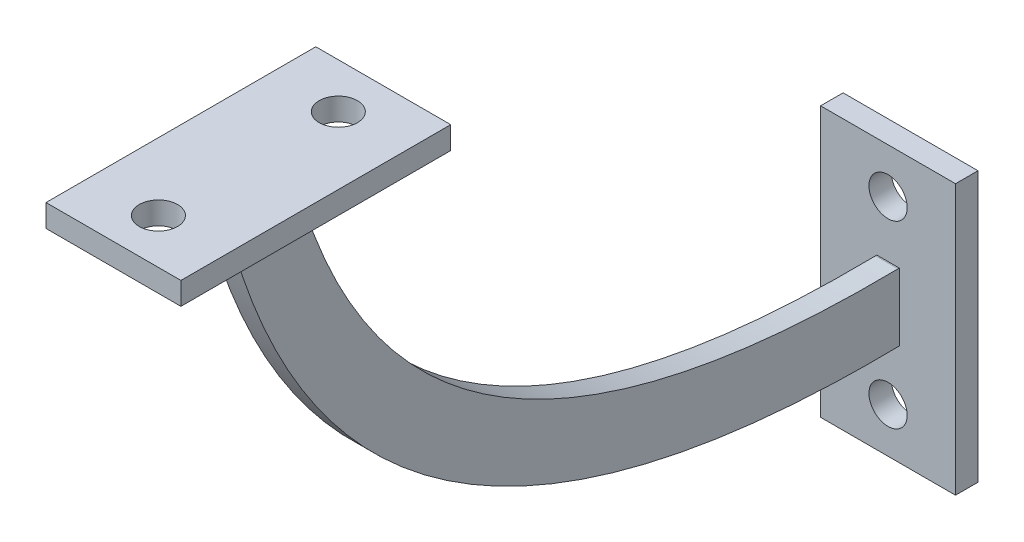
ISO-10303-21;
HEADER;
FILE_DESCRIPTION(('STEP AP214'),'2;1');
FILE_NAME('part.step','',(''),(''),'','','');
FILE_SCHEMA(('AUTOMOTIVE_DESIGN { 1 0 10303 214 1 1 1 1 }'));
ENDSEC;
DATA;
#1=APPLICATION_CONTEXT('core data for automotive mechanical design processes');
#2=APPLICATION_PROTOCOL_DEFINITION('international standard','automotive_design',2000,#1);
#3=PRODUCT_CONTEXT('',#1,'mechanical');
#4=PRODUCT('Part','Part','',(#3));
#5=PRODUCT_RELATED_PRODUCT_CATEGORY('part','',(#4));
#6=PRODUCT_DEFINITION_FORMATION('','',#4);
#7=PRODUCT_DEFINITION_CONTEXT('part definition',#1,'design');
#8=PRODUCT_DEFINITION('design','',#6,#7);
#9=PRODUCT_DEFINITION_SHAPE('','',#8);
#10=(LENGTH_UNIT() NAMED_UNIT(*) SI_UNIT(.MILLI.,.METRE.));
#11=(NAMED_UNIT(*) PLANE_ANGLE_UNIT() SI_UNIT($,.RADIAN.));
#12=(NAMED_UNIT(*) SI_UNIT($,.STERADIAN.) SOLID_ANGLE_UNIT());
#13=UNCERTAINTY_MEASURE_WITH_UNIT(LENGTH_MEASURE(1.E-05),#10,'distance_accuracy_value','');
#14=(GEOMETRIC_REPRESENTATION_CONTEXT(3) GLOBAL_UNCERTAINTY_ASSIGNED_CONTEXT((#13)) GLOBAL_UNIT_ASSIGNED_CONTEXT((#10,
#11,#12)) REPRESENTATION_CONTEXT('',''));
#15=CARTESIAN_POINT('',(0.,0.,0.));
#16=DIRECTION('',(0.,0.,1.));
#17=DIRECTION('',(1.,0.,0.));
#18=AXIS2_PLACEMENT_3D('',#15,#16,#17);
#19=CARTESIAN_POINT('',(5.,100.,150.));
#20=CARTESIAN_POINT('',(5.,-2.14164180963556,124.823277557777));
#21=CARTESIAN_POINT('',(5.,0.,0.));
#22=B_SPLINE_CURVE_WITH_KNOTS('',2,(#19,#20,#21),.UNSPECIFIED.,.F.,.F.,(3,3),(0.,1.),.UNSPECIFIED.);
#23=DIRECTION('',(-1.,0.,0.));
#24=VECTOR('',#23,1.);
#25=SURFACE_OF_LINEAR_EXTRUSION('',#22,#24);
#26=CARTESIAN_POINT('',(0.,100.,150.));
#27=CARTESIAN_POINT('',(0.,-2.14164180963556,124.823277557777));
#28=CARTESIAN_POINT('',(0.,0.,0.));
#29=B_SPLINE_CURVE_WITH_KNOTS('',2,(#26,#27,#28),.UNSPECIFIED.,.F.,.F.,(3,3),(0.,1.),.UNSPECIFIED.);
#30=CARTESIAN_POINT('',(0.,99.9999999999997,150.));
#31=VERTEX_POINT('',#30);
#32=CARTESIAN_POINT('',(0.,0.,0.));
#33=VERTEX_POINT('',#32);
#34=EDGE_CURVE('E139',#31,#33,#29,.T.);
#35=ORIENTED_EDGE('',*,*,#34,.T.);
#36=DIRECTION('',(-1.,0.,0.));
#37=VECTOR('',#36,1.);
#38=CARTESIAN_POINT('',(5.,0.,0.));
#39=LINE('',#38,#37);
#40=CARTESIAN_POINT('',(5.,0.,0.));
#41=VERTEX_POINT('',#40);
#42=EDGE_CURVE('E11',#41,#33,#39,.T.);
#43=ORIENTED_EDGE('',*,*,#42,.F.);
#44=CARTESIAN_POINT('',(5.,100.,150.));
#45=VERTEX_POINT('',#44);
#46=EDGE_CURVE('E86',#45,#41,#22,.T.);
#47=ORIENTED_EDGE('',*,*,#46,.F.);
#48=DIRECTION('',(-1.,0.,0.));
#49=VECTOR('',#48,1.);
#50=CARTESIAN_POINT('',(5.,100.,150.));
#51=LINE('',#50,#49);
#52=EDGE_CURVE('E114',#45,#31,#51,.T.);
#53=ORIENTED_EDGE('',*,*,#52,.T.);
#54=EDGE_LOOP('',(#35,#43,#47,#53));
#55=FACE_BOUND('',#54,.T.);
#56=ADVANCED_FACE('F41',(#55),#25,.F.);
#57=CARTESIAN_POINT('',(5.,14.9977926667699,0.257322996606405));
#58=DIRECTION('',(0.,-0.999963210436096,-0.0085777487918578));
#59=DIRECTION('',(0.,0.0085777487918578,-0.999963210436096));
#60=AXIS2_PLACEMENT_3D('',#57,#58,#59);
#61=PLANE('',#60);
#62=DIRECTION('',(0.,-0.0085777487918578,0.999963210436096));
#63=VECTOR('',#62,1.);
#64=CARTESIAN_POINT('',(0.,14.9977926667699,0.257322996606405));
#65=LINE('',#64,#63);
#66=CARTESIAN_POINT('',(0.,15.,0.));
#67=VERTEX_POINT('',#66);
#68=CARTESIAN_POINT('',(0.,14.9977926667699,0.257322996606405));
#69=VERTEX_POINT('',#68);
#70=EDGE_CURVE('E73',#67,#69,#65,.T.);
#71=ORIENTED_EDGE('',*,*,#70,.T.);
#72=DIRECTION('',(-1.,0.,0.));
#73=VECTOR('',#72,1.);
#74=CARTESIAN_POINT('',(5.,14.9977926667699,0.257322996606405));
#75=LINE('',#74,#73);
#76=CARTESIAN_POINT('',(5.,14.9977926667699,0.257322996606405));
#77=VERTEX_POINT('',#76);
#78=EDGE_CURVE('E103',#77,#69,#75,.T.);
#79=ORIENTED_EDGE('',*,*,#78,.F.);
#80=DIRECTION('',(0.,-0.0085777487918578,0.999963210436096));
#81=VECTOR('',#80,1.);
#82=CARTESIAN_POINT('',(5.,14.9977926667699,0.257322996606405));
#83=LINE('',#82,#81);
#84=CARTESIAN_POINT('',(5.,15.,0.));
#85=VERTEX_POINT('',#84);
#86=EDGE_CURVE('E93',#85,#77,#83,.T.);
#87=ORIENTED_EDGE('',*,*,#86,.F.);
#88=DIRECTION('',(-1.,0.,0.));
#89=VECTOR('',#88,1.);
#90=CARTESIAN_POINT('',(5.,15.,0.));
#91=LINE('',#90,#89);
#92=EDGE_CURVE('E51',#85,#67,#91,.T.);
#93=ORIENTED_EDGE('',*,*,#92,.T.);
#94=EDGE_LOOP('',(#71,#79,#87,#93));
#95=FACE_BOUND('',#94,.T.);
#96=ADVANCED_FACE('F104',(#95),#61,.F.);
#97=CARTESIAN_POINT('',(5.,14.9977926667699,0.257322996606407));
#98=CARTESIAN_POINT('',(5.,14.6393775309061,22.513069097096));
#99=CARTESIAN_POINT('',(5.,19.6797432725881,53.120235991017));
#100=CARTESIAN_POINT('',(5.,26.5385989413839,74.1752355396005));
#101=CARTESIAN_POINT('',(5.,36.0765405139787,91.9642188804717));
#102=CARTESIAN_POINT('',(5.,48.2663544222022,106.790873122833));
#103=CARTESIAN_POINT('',(5.,63.2983661781123,118.971580699375));
#104=CARTESIAN_POINT('',(5.,86.044389394246,131.079744309968));
#105=CARTESIAN_POINT('',(5.,103.588437748394,135.441554164153));
#106=B_SPLINE_CURVE_WITH_KNOTS('',2,(#97,#98,#99,#100,#101,#102,#103,#104,#105),.UNSPECIFIED.,
.F.,.F.,(3,1,1,1,1,1,1,3),(0.,0.1875,0.3125,0.4375,0.5625,0.6875,0.8125,1.),.UNSPECIFIED.);
#107=DIRECTION('',(-1.,0.,0.));
#108=VECTOR('',#107,1.);
#109=SURFACE_OF_LINEAR_EXTRUSION('',#106,#108);
#110=CARTESIAN_POINT('',(0.,14.9977926667699,0.257322996606407));
#111=CARTESIAN_POINT('',(0.,14.6393775309061,22.513069097096));
#112=CARTESIAN_POINT('',(0.,19.6797432725881,53.120235991017));
#113=CARTESIAN_POINT('',(0.,26.5385989413839,74.1752355396005));
#114=CARTESIAN_POINT('',(0.,36.0765405139787,91.9642188804717));
#115=CARTESIAN_POINT('',(0.,48.2663544222022,106.790873122833));
#116=CARTESIAN_POINT('',(0.,63.2983661781123,118.971580699375));
#117=CARTESIAN_POINT('',(0.,86.044389394246,131.079744309968));
#118=CARTESIAN_POINT('',(0.,103.588437748394,135.441554164153));
#119=B_SPLINE_CURVE_WITH_KNOTS('',2,(#110,#111,#112,#113,#114,#115,#116,#117,#118),
.UNSPECIFIED.,.F.,.F.,(3,1,1,1,1,1,1,3),(0.,0.1875,0.3125,0.4375,0.5625,0.6875,0.8125,1.),.UNSPECIFIED.);
#120=CARTESIAN_POINT('',(0.,100.,134.50795277409));
#121=VERTEX_POINT('',#120);
#122=EDGE_CURVE('E556',#69,#121,#119,.T.);
#123=ORIENTED_EDGE('',*,*,#122,.T.);
#124=DIRECTION('',(-1.,0.,0.));
#125=VECTOR('',#124,1.);
#126=CARTESIAN_POINT('',(5.,100.,134.50795277409));
#127=LINE('',#126,#125);
#128=CARTESIAN_POINT('',(5.,100.,134.50795277409));
#129=VERTEX_POINT('',#128);
#130=EDGE_CURVE('E107',#129,#121,#127,.T.);
#131=ORIENTED_EDGE('',*,*,#130,.F.);
#132=EDGE_CURVE('E96',#77,#129,#106,.T.);
#133=ORIENTED_EDGE('',*,*,#132,.F.);
#134=ORIENTED_EDGE('',*,*,#78,.T.);
#135=EDGE_LOOP('',(#123,#131,#133,#134));
#136=FACE_BOUND('',#135,.T.);
#137=ADVANCED_FACE('F109',(#136),#109,.F.);
#138=CARTESIAN_POINT('',(5.,23.9291790951822,99.9116387788885));
#139=DIRECTION('',(1.,0.,0.));
#140=DIRECTION('',(0.,0.,-1.));
#141=AXIS2_PLACEMENT_3D('',#138,#139,#140);
#142=PLANE('',#141);
#143=ORIENTED_EDGE('',*,*,#46,.T.);
#144=DIRECTION('',(0.,1.,0.));
#145=VECTOR('',#144,1.);
#146=CARTESIAN_POINT('',(5.,0.,0.));
#147=LINE('',#146,#145);
#148=EDGE_CURVE('E99',#41,#85,#147,.T.);
#149=ORIENTED_EDGE('',*,*,#148,.T.);
#150=ORIENTED_EDGE('',*,*,#86,.T.);
#151=ORIENTED_EDGE('',*,*,#132,.T.);
#152=DIRECTION('',(0.,0.,1.));
#153=VECTOR('',#152,1.);
#154=CARTESIAN_POINT('',(5.,100.,135.));
#155=LINE('',#154,#153);
#156=EDGE_CURVE('E59',#129,#45,#155,.T.);
#157=ORIENTED_EDGE('',*,*,#156,.T.);
#158=EDGE_LOOP('',(#143,#149,#150,#151,#157));
#159=FACE_BOUND('',#158,.T.);
#160=ADVANCED_FACE('F94',(#159),#142,.T.);
#161=CARTESIAN_POINT('',(0.,23.9291790951822,99.9116387788885));
#162=DIRECTION('',(1.,0.,0.));
#163=DIRECTION('',(0.,0.,-1.));
#164=AXIS2_PLACEMENT_3D('',#161,#162,#163);
#165=PLANE('',#164);
#166=ORIENTED_EDGE('',*,*,#34,.F.);
#167=DIRECTION('',(0.,0.,1.));
#168=VECTOR('',#167,1.);
#169=CARTESIAN_POINT('',(0.,100.,150.));
#170=LINE('',#169,#168);
#171=EDGE_CURVE('E81',#121,#31,#170,.T.);
#172=ORIENTED_EDGE('',*,*,#171,.F.);
#173=ORIENTED_EDGE('',*,*,#122,.F.);
#174=ORIENTED_EDGE('',*,*,#70,.F.);
#175=DIRECTION('',(0.,1.,0.));
#176=VECTOR('',#175,1.);
#177=CARTESIAN_POINT('',(0.,0.,0.));
#178=LINE('',#177,#176);
#179=EDGE_CURVE('E146',#33,#67,#178,.T.);
#180=ORIENTED_EDGE('',*,*,#179,.F.);
#181=EDGE_LOOP('',(#166,#172,#173,#174,#180));
#182=FACE_BOUND('',#181,.T.);
#183=ADVANCED_FACE('F127',(#182),#165,.F.);
#184=CARTESIAN_POINT('',(0.,105.,2.18614614331551E-13));
#185=DIRECTION('',(0.,-1.,0.));
#186=DIRECTION('',(0.,0.,-1.));
#187=AXIS2_PLACEMENT_3D('',#184,#185,#186);
#188=PLANE('',#187);
#189=DIRECTION('',(0.,0.,-1.));
#190=VECTOR('',#189,1.);
#191=CARTESIAN_POINT('',(17.5,105.,172.253976387045));
#192=LINE('',#191,#190);
#193=CARTESIAN_POINT('',(17.5,105.,172.253976387045));
#194=VERTEX_POINT('',#193);
#195=CARTESIAN_POINT('',(17.5,105.,112.253976387045));
#196=VERTEX_POINT('',#195);
#197=EDGE_CURVE('E182',#194,#196,#192,.T.);
#198=ORIENTED_EDGE('',*,*,#197,.T.);
#199=DIRECTION('',(-1.,0.,0.));
#200=VECTOR('',#199,1.);
#201=CARTESIAN_POINT('',(-12.5,105.,112.253976387045));
#202=LINE('',#201,#200);
#203=CARTESIAN_POINT('',(-12.5,105.,112.253976387045));
#204=VERTEX_POINT('',#203);
#205=EDGE_CURVE('E203',#196,#204,#202,.T.);
#206=ORIENTED_EDGE('',*,*,#205,.T.);
#207=DIRECTION('',(0.,0.,1.));
#208=VECTOR('',#207,1.);
#209=CARTESIAN_POINT('',(-12.5,105.,172.253976387045));
#210=LINE('',#209,#208);
#211=CARTESIAN_POINT('',(-12.5,105.,172.253976387045));
#212=VERTEX_POINT('',#211);
#213=EDGE_CURVE('E199',#204,#212,#210,.T.);
#214=ORIENTED_EDGE('',*,*,#213,.T.);
#215=DIRECTION('',(1.,0.,0.));
#216=VECTOR('',#215,1.);
#217=CARTESIAN_POINT('',(-12.5,105.,172.253976387045));
#218=LINE('',#217,#216);
#219=EDGE_CURVE('E177',#212,#194,#218,.T.);
#220=ORIENTED_EDGE('',*,*,#219,.T.);
#221=EDGE_LOOP('',(#198,#206,#214,#220));
#222=FACE_BOUND('',#221,.T.);
#223=CARTESIAN_POINT('',(2.5,105.,162.253976387045));
#224=DIRECTION('',(0.,1.,0.));
#225=DIRECTION('',(0.,0.,1.));
#226=AXIS2_PLACEMENT_3D('',#223,#224,#225);
#227=CIRCLE('',#226,4.25);
#228=CARTESIAN_POINT('',(2.5,105.,166.503976387045));
#229=VERTEX_POINT('',#228);
#230=EDGE_CURVE('E195',#229,#229,#227,.T.);
#231=ORIENTED_EDGE('',*,*,#230,.F.);
#232=EDGE_LOOP('',(#231));
#233=FACE_BOUND('',#232,.T.);
#234=CARTESIAN_POINT('',(2.5,105.,122.253976387045));
#235=DIRECTION('',(0.,1.,0.));
#236=DIRECTION('',(0.,0.,-1.));
#237=AXIS2_PLACEMENT_3D('',#234,#235,#236);
#238=CIRCLE('',#237,4.25);
#239=CARTESIAN_POINT('',(2.5,105.,118.003976387045));
#240=VERTEX_POINT('',#239);
#241=EDGE_CURVE('E214',#240,#240,#238,.T.);
#242=ORIENTED_EDGE('',*,*,#241,.F.);
#243=EDGE_LOOP('',(#242));
#244=FACE_BOUND('',#243,.T.);
#245=ADVANCED_FACE('F344',(#222,#233,#244),#188,.F.);
#246=CARTESIAN_POINT('',(0.,100.,2.08166817117217E-13));
#247=DIRECTION('',(0.,-1.,0.));
#248=DIRECTION('',(0.,0.,-1.));
#249=AXIS2_PLACEMENT_3D('',#246,#247,#248);
#250=PLANE('',#249);
#251=ORIENTED_EDGE('',*,*,#52,.F.);
#252=ORIENTED_EDGE('',*,*,#156,.F.);
#253=ORIENTED_EDGE('',*,*,#130,.T.);
#254=ORIENTED_EDGE('',*,*,#171,.T.);
#255=EDGE_LOOP('',(#251,#252,#253,#254));
#256=FACE_BOUND('',#255,.T.);
#257=CARTESIAN_POINT('',(2.5,99.9999999999997,162.253976387045));
#258=DIRECTION('',(0.,1.,0.));
#259=DIRECTION('',(0.,0.,1.));
#260=AXIS2_PLACEMENT_3D('',#257,#258,#259);
#261=CIRCLE('',#260,4.25);
#262=CARTESIAN_POINT('',(2.5,99.9999999999997,166.503976387045));
#263=VERTEX_POINT('',#262);
#264=EDGE_CURVE('E210',#263,#263,#261,.T.);
#265=ORIENTED_EDGE('',*,*,#264,.T.);
#266=EDGE_LOOP('',(#265));
#267=FACE_BOUND('',#266,.T.);
#268=DIRECTION('',(0.,0.,-1.));
#269=VECTOR('',#268,1.);
#270=CARTESIAN_POINT('',(17.5,99.9999999999996,172.253976387045));
#271=LINE('',#270,#269);
#272=CARTESIAN_POINT('',(17.5,99.9999999999996,172.253976387045));
#273=VERTEX_POINT('',#272);
#274=CARTESIAN_POINT('',(17.5,99.9999999999998,112.253976387045));
#275=VERTEX_POINT('',#274);
#276=EDGE_CURVE('E191',#273,#275,#271,.T.);
#277=ORIENTED_EDGE('',*,*,#276,.F.);
#278=DIRECTION('',(1.,0.,0.));
#279=VECTOR('',#278,1.);
#280=CARTESIAN_POINT('',(-12.5,99.9999999999996,172.253976387045));
#281=LINE('',#280,#279);
#282=CARTESIAN_POINT('',(-12.5,99.9999999999996,172.253976387045));
#283=VERTEX_POINT('',#282);
#284=EDGE_CURVE('E178',#283,#273,#281,.T.);
#285=ORIENTED_EDGE('',*,*,#284,.F.);
#286=DIRECTION('',(0.,0.,1.));
#287=VECTOR('',#286,1.);
#288=CARTESIAN_POINT('',(-12.5,99.9999999999996,172.253976387045));
#289=LINE('',#288,#287);
#290=CARTESIAN_POINT('',(-12.5,99.9999999999998,112.253976387045));
#291=VERTEX_POINT('',#290);
#292=EDGE_CURVE('E183',#291,#283,#289,.T.);
#293=ORIENTED_EDGE('',*,*,#292,.F.);
#294=DIRECTION('',(-1.,0.,0.));
#295=VECTOR('',#294,1.);
#296=CARTESIAN_POINT('',(-12.5,99.9999999999998,112.253976387045));
#297=LINE('',#296,#295);
#298=EDGE_CURVE('E187',#275,#291,#297,.T.);
#299=ORIENTED_EDGE('',*,*,#298,.F.);
#300=EDGE_LOOP('',(#277,#285,#293,#299));
#301=FACE_BOUND('',#300,.T.);
#302=CARTESIAN_POINT('',(2.5,99.9999999999998,122.253976387045));
#303=DIRECTION('',(0.,1.,0.));
#304=DIRECTION('',(0.,0.,-1.));
#305=AXIS2_PLACEMENT_3D('',#302,#303,#304);
#306=CIRCLE('',#305,4.25);
#307=CARTESIAN_POINT('',(2.5,99.9999999999998,118.003976387045));
#308=VERTEX_POINT('',#307);
#309=EDGE_CURVE('E218',#308,#308,#306,.T.);
#310=ORIENTED_EDGE('',*,*,#309,.T.);
#311=EDGE_LOOP('',(#310));
#312=FACE_BOUND('',#311,.T.);
#313=ADVANCED_FACE('F347',(#256,#267,#301,#312),#250,.T.);
#314=CARTESIAN_POINT('',(17.5,105.,172.253976387045));
#315=DIRECTION('',(-1.,0.,0.));
#316=DIRECTION('',(0.,0.,1.));
#317=AXIS2_PLACEMENT_3D('',#314,#315,#316);
#318=PLANE('',#317);
#319=ORIENTED_EDGE('',*,*,#276,.T.);
#320=DIRECTION('',(0.,-1.,0.));
#321=VECTOR('',#320,1.);
#322=CARTESIAN_POINT('',(17.5,105.,112.253976387045));
#323=LINE('',#322,#321);
#324=EDGE_CURVE('E147',#196,#275,#323,.T.);
#325=ORIENTED_EDGE('',*,*,#324,.F.);
#326=ORIENTED_EDGE('',*,*,#197,.F.);
#327=DIRECTION('',(0.,-1.,0.));
#328=VECTOR('',#327,1.);
#329=CARTESIAN_POINT('',(17.5,105.,172.253976387045));
#330=LINE('',#329,#328);
#331=EDGE_CURVE('E173',#194,#273,#330,.T.);
#332=ORIENTED_EDGE('',*,*,#331,.T.);
#333=EDGE_LOOP('',(#319,#325,#326,#332));
#334=FACE_BOUND('',#333,.T.);
#335=ADVANCED_FACE('F351',(#334),#318,.F.);
#336=CARTESIAN_POINT('',(-12.5,105.,112.253976387045));
#337=DIRECTION('',(0.,0.,1.));
#338=DIRECTION('',(0.,-1.,0.));
#339=AXIS2_PLACEMENT_3D('',#336,#337,#338);
#340=PLANE('',#339);
#341=ORIENTED_EDGE('',*,*,#298,.T.);
#342=DIRECTION('',(0.,-1.,0.));
#343=VECTOR('',#342,1.);
#344=CARTESIAN_POINT('',(-12.5,105.,112.253976387045));
#345=LINE('',#344,#343);
#346=EDGE_CURVE('E165',#204,#291,#345,.T.);
#347=ORIENTED_EDGE('',*,*,#346,.F.);
#348=ORIENTED_EDGE('',*,*,#205,.F.);
#349=ORIENTED_EDGE('',*,*,#324,.T.);
#350=EDGE_LOOP('',(#341,#347,#348,#349));
#351=FACE_BOUND('',#350,.T.);
#352=ADVANCED_FACE('F359',(#351),#340,.F.);
#353=CARTESIAN_POINT('',(-12.5,105.,172.253976387045));
#354=DIRECTION('',(1.,0.,0.));
#355=DIRECTION('',(0.,0.,-1.));
#356=AXIS2_PLACEMENT_3D('',#353,#354,#355);
#357=PLANE('',#356);
#358=ORIENTED_EDGE('',*,*,#292,.T.);
#359=DIRECTION('',(0.,-1.,0.));
#360=VECTOR('',#359,1.);
#361=CARTESIAN_POINT('',(-12.5,105.,172.253976387045));
#362=LINE('',#361,#360);
#363=EDGE_CURVE('E169',#212,#283,#362,.T.);
#364=ORIENTED_EDGE('',*,*,#363,.F.);
#365=ORIENTED_EDGE('',*,*,#213,.F.);
#366=ORIENTED_EDGE('',*,*,#346,.T.);
#367=EDGE_LOOP('',(#358,#364,#365,#366));
#368=FACE_BOUND('',#367,.T.);
#369=ADVANCED_FACE('F355',(#368),#357,.F.);
#370=CARTESIAN_POINT('',(-12.5,105.,172.253976387045));
#371=DIRECTION('',(0.,0.,-1.));
#372=DIRECTION('',(0.,1.,0.));
#373=AXIS2_PLACEMENT_3D('',#370,#371,#372);
#374=PLANE('',#373);
#375=ORIENTED_EDGE('',*,*,#284,.T.);
#376=ORIENTED_EDGE('',*,*,#331,.F.);
#377=ORIENTED_EDGE('',*,*,#219,.F.);
#378=ORIENTED_EDGE('',*,*,#363,.T.);
#379=EDGE_LOOP('',(#375,#376,#377,#378));
#380=FACE_BOUND('',#379,.T.);
#381=ADVANCED_FACE('F342',(#380),#374,.F.);
#382=CARTESIAN_POINT('',(2.5,105.,162.253976387045));
#383=DIRECTION('',(0.,-1.,0.));
#384=DIRECTION('',(0.,0.,-1.));
#385=AXIS2_PLACEMENT_3D('',#382,#383,#384);
#386=CYLINDRICAL_SURFACE('',#385,4.25);
#387=ORIENTED_EDGE('',*,*,#230,.T.);
#388=EDGE_LOOP('',(#387));
#389=FACE_BOUND('',#388,.T.);
#390=ORIENTED_EDGE('',*,*,#264,.F.);
#391=EDGE_LOOP('',(#390));
#392=FACE_BOUND('',#391,.T.);
#393=ADVANCED_FACE('F322',(#389,#392),#386,.F.);
#394=CARTESIAN_POINT('',(2.5,105.,122.253976387045));
#395=DIRECTION('',(0.,-1.,0.));
#396=DIRECTION('',(0.,0.,-1.));
#397=AXIS2_PLACEMENT_3D('',#394,#395,#396);
#398=CYLINDRICAL_SURFACE('',#397,4.25);
#399=ORIENTED_EDGE('',*,*,#241,.T.);
#400=EDGE_LOOP('',(#399));
#401=FACE_BOUND('',#400,.T.);
#402=ORIENTED_EDGE('',*,*,#309,.F.);
#403=EDGE_LOOP('',(#402));
#404=FACE_BOUND('',#403,.T.);
#405=ADVANCED_FACE('F312',(#401,#404),#398,.F.);
#406=CARTESIAN_POINT('',(0.,0.,0.));
#407=DIRECTION('',(0.,0.,-1.));
#408=DIRECTION('',(0.,1.,0.));
#409=AXIS2_PLACEMENT_3D('',#406,#407,#408);
#410=PLANE('',#409);
#411=CARTESIAN_POINT('',(2.5,27.5,0.));
#412=DIRECTION('',(0.,0.,-1.));
#413=DIRECTION('',(0.,1.,0.));
#414=AXIS2_PLACEMENT_3D('',#411,#412,#413);
#415=CIRCLE('',#414,4.25);
#416=CARTESIAN_POINT('',(2.5,31.75,0.));
#417=VERTEX_POINT('',#416);
#418=EDGE_CURVE('E263',#417,#417,#415,.T.);
#419=ORIENTED_EDGE('',*,*,#418,.T.);
#420=EDGE_LOOP('',(#419));
#421=FACE_BOUND('',#420,.T.);
#422=DIRECTION('',(-1.,0.,0.));
#423=VECTOR('',#422,1.);
#424=CARTESIAN_POINT('',(0.,-22.5,0.));
#425=LINE('',#424,#423);
#426=CARTESIAN_POINT('',(17.5,-22.5,0.));
#427=VERTEX_POINT('',#426);
#428=CARTESIAN_POINT('',(-12.5,-22.5,0.));
#429=VERTEX_POINT('',#428);
#430=EDGE_CURVE('E259',#427,#429,#425,.T.);
#431=ORIENTED_EDGE('',*,*,#430,.F.);
#432=DIRECTION('',(0.,1.,0.));
#433=VECTOR('',#432,1.);
#434=CARTESIAN_POINT('',(17.5,0.,0.));
#435=LINE('',#434,#433);
#436=CARTESIAN_POINT('',(17.5,37.5,0.));
#437=VERTEX_POINT('',#436);
#438=EDGE_CURVE('E247',#427,#437,#435,.T.);
#439=ORIENTED_EDGE('',*,*,#438,.T.);
#440=DIRECTION('',(-1.,0.,0.));
#441=VECTOR('',#440,1.);
#442=CARTESIAN_POINT('',(0.,37.5,0.));
#443=LINE('',#442,#441);
#444=CARTESIAN_POINT('',(-12.5,37.5,0.));
#445=VERTEX_POINT('',#444);
#446=EDGE_CURVE('E251',#437,#445,#443,.T.);
#447=ORIENTED_EDGE('',*,*,#446,.T.);
#448=DIRECTION('',(0.,1.,0.));
#449=VECTOR('',#448,1.);
#450=CARTESIAN_POINT('',(-12.5,0.,0.));
#451=LINE('',#450,#449);
#452=EDGE_CURVE('E255',#429,#445,#451,.T.);
#453=ORIENTED_EDGE('',*,*,#452,.F.);
#454=EDGE_LOOP('',(#431,#439,#447,#453));
#455=FACE_BOUND('',#454,.T.);
#456=CARTESIAN_POINT('',(2.5,-12.5,0.));
#457=DIRECTION('',(0.,0.,-1.));
#458=DIRECTION('',(0.,1.,0.));
#459=AXIS2_PLACEMENT_3D('',#456,#457,#458);
#460=CIRCLE('',#459,4.25);
#461=CARTESIAN_POINT('',(2.5,-8.25,0.));
#462=VERTEX_POINT('',#461);
#463=EDGE_CURVE('E242',#462,#462,#460,.F.);
#464=ORIENTED_EDGE('',*,*,#463,.F.);
#465=EDGE_LOOP('',(#464));
#466=FACE_BOUND('',#465,.T.);
#467=ORIENTED_EDGE('',*,*,#42,.T.);
#468=ORIENTED_EDGE('',*,*,#179,.T.);
#469=ORIENTED_EDGE('',*,*,#92,.F.);
#470=ORIENTED_EDGE('',*,*,#148,.F.);
#471=EDGE_LOOP('',(#467,#468,#469,#470));
#472=FACE_BOUND('',#471,.T.);
#473=ADVANCED_FACE('F152',(#421,#455,#466,#472),#410,.F.);
#474=CARTESIAN_POINT('',(0.,-22.5,-5.));
#475=DIRECTION('',(0.,1.,0.));
#476=DIRECTION('',(0.,0.,1.));
#477=AXIS2_PLACEMENT_3D('',#474,#475,#476);
#478=PLANE('',#477);
#479=ORIENTED_EDGE('',*,*,#430,.T.);
#480=DIRECTION('',(0.,0.,1.));
#481=VECTOR('',#480,1.);
#482=CARTESIAN_POINT('',(-12.5,-22.5,-5.));
#483=LINE('',#482,#481);
#484=CARTESIAN_POINT('',(-12.5,-22.5,-5.));
#485=VERTEX_POINT('',#484);
#486=EDGE_CURVE('E222',#485,#429,#483,.T.);
#487=ORIENTED_EDGE('',*,*,#486,.F.);
#488=DIRECTION('',(-1.,0.,0.));
#489=VECTOR('',#488,1.);
#490=CARTESIAN_POINT('',(0.,-22.5,-5.));
#491=LINE('',#490,#489);
#492=CARTESIAN_POINT('',(17.5,-22.5,-5.));
#493=VERTEX_POINT('',#492);
#494=EDGE_CURVE('E282',#493,#485,#491,.T.);
#495=ORIENTED_EDGE('',*,*,#494,.F.);
#496=DIRECTION('',(0.,0.,1.));
#497=VECTOR('',#496,1.);
#498=CARTESIAN_POINT('',(17.5,-22.5,-5.));
#499=LINE('',#498,#497);
#500=EDGE_CURVE('E237',#493,#427,#499,.T.);
#501=ORIENTED_EDGE('',*,*,#500,.T.);
#502=EDGE_LOOP('',(#479,#487,#495,#501));
#503=FACE_BOUND('',#502,.T.);
#504=ADVANCED_FACE('F311',(#503),#478,.F.);
#505=CARTESIAN_POINT('',(-12.5,0.,-5.));
#506=DIRECTION('',(1.,0.,0.));
#507=DIRECTION('',(0.,0.,-1.));
#508=AXIS2_PLACEMENT_3D('',#505,#506,#507);
#509=PLANE('',#508);
#510=ORIENTED_EDGE('',*,*,#452,.T.);
#511=DIRECTION('',(0.,0.,1.));
#512=VECTOR('',#511,1.);
#513=CARTESIAN_POINT('',(-12.5,37.5,-5.));
#514=LINE('',#513,#512);
#515=CARTESIAN_POINT('',(-12.5,37.5,-5.));
#516=VERTEX_POINT('',#515);
#517=EDGE_CURVE('E229',#516,#445,#514,.T.);
#518=ORIENTED_EDGE('',*,*,#517,.F.);
#519=DIRECTION('',(0.,1.,0.));
#520=VECTOR('',#519,1.);
#521=CARTESIAN_POINT('',(-12.5,0.,-5.));
#522=LINE('',#521,#520);
#523=EDGE_CURVE('E278',#485,#516,#522,.T.);
#524=ORIENTED_EDGE('',*,*,#523,.F.);
#525=ORIENTED_EDGE('',*,*,#486,.T.);
#526=EDGE_LOOP('',(#510,#518,#524,#525));
#527=FACE_BOUND('',#526,.T.);
#528=ADVANCED_FACE('F319',(#527),#509,.F.);
#529=CARTESIAN_POINT('',(0.,37.5,-5.));
#530=DIRECTION('',(0.,1.,0.));
#531=DIRECTION('',(0.,0.,1.));
#532=AXIS2_PLACEMENT_3D('',#529,#530,#531);
#533=PLANE('',#532);
#534=ORIENTED_EDGE('',*,*,#446,.F.);
#535=DIRECTION('',(0.,0.,1.));
#536=VECTOR('',#535,1.);
#537=CARTESIAN_POINT('',(17.5,37.5,-5.));
#538=LINE('',#537,#536);
#539=CARTESIAN_POINT('',(17.5,37.5,-5.));
#540=VERTEX_POINT('',#539);
#541=EDGE_CURVE('E233',#540,#437,#538,.T.);
#542=ORIENTED_EDGE('',*,*,#541,.F.);
#543=DIRECTION('',(-1.,0.,0.));
#544=VECTOR('',#543,1.);
#545=CARTESIAN_POINT('',(0.,37.5,-5.));
#546=LINE('',#545,#544);
#547=EDGE_CURVE('E274',#540,#516,#546,.T.);
#548=ORIENTED_EDGE('',*,*,#547,.T.);
#549=ORIENTED_EDGE('',*,*,#517,.T.);
#550=EDGE_LOOP('',(#534,#542,#548,#549));
#551=FACE_BOUND('',#550,.T.);
#552=ADVANCED_FACE('F330',(#551),#533,.T.);
#553=CARTESIAN_POINT('',(17.5,0.,-5.));
#554=DIRECTION('',(1.,0.,0.));
#555=DIRECTION('',(0.,0.,-1.));
#556=AXIS2_PLACEMENT_3D('',#553,#554,#555);
#557=PLANE('',#556);
#558=ORIENTED_EDGE('',*,*,#438,.F.);
#559=ORIENTED_EDGE('',*,*,#500,.F.);
#560=DIRECTION('',(0.,1.,0.));
#561=VECTOR('',#560,1.);
#562=CARTESIAN_POINT('',(17.5,0.,-5.));
#563=LINE('',#562,#561);
#564=EDGE_CURVE('E270',#493,#540,#563,.T.);
#565=ORIENTED_EDGE('',*,*,#564,.T.);
#566=ORIENTED_EDGE('',*,*,#541,.T.);
#567=EDGE_LOOP('',(#558,#559,#565,#566));
#568=FACE_BOUND('',#567,.T.);
#569=ADVANCED_FACE('F327',(#568),#557,.T.);
#570=CARTESIAN_POINT('',(2.5,27.5,-5.));
#571=DIRECTION('',(0.,0.,1.));
#572=DIRECTION('',(0.,-1.,0.));
#573=AXIS2_PLACEMENT_3D('',#570,#571,#572);
#574=CYLINDRICAL_SURFACE('',#573,4.25);
#575=CARTESIAN_POINT('',(2.5,27.5,-5.));
#576=DIRECTION('',(0.,0.,-1.));
#577=DIRECTION('',(0.,1.,0.));
#578=AXIS2_PLACEMENT_3D('',#575,#576,#577);
#579=CIRCLE('',#578,4.25);
#580=CARTESIAN_POINT('',(2.5,31.75,-5.));
#581=VERTEX_POINT('',#580);
#582=EDGE_CURVE('E246',#581,#581,#579,.T.);
#583=ORIENTED_EDGE('',*,*,#582,.T.);
#584=EDGE_LOOP('',(#583));
#585=FACE_BOUND('',#584,.T.);
#586=ORIENTED_EDGE('',*,*,#418,.F.);
#587=EDGE_LOOP('',(#586));
#588=FACE_BOUND('',#587,.T.);
#589=ADVANCED_FACE('F290',(#585,#588),#574,.F.);
#590=CARTESIAN_POINT('',(2.5,-12.5,-5.));
#591=DIRECTION('',(0.,0.,1.));
#592=DIRECTION('',(0.,-1.,0.));
#593=AXIS2_PLACEMENT_3D('',#590,#591,#592);
#594=CYLINDRICAL_SURFACE('',#593,4.25);
#595=CARTESIAN_POINT('',(2.5,-12.5,-5.));
#596=DIRECTION('',(0.,0.,-1.));
#597=DIRECTION('',(0.,1.,0.));
#598=AXIS2_PLACEMENT_3D('',#595,#596,#597);
#599=CIRCLE('',#598,4.25);
#600=CARTESIAN_POINT('',(2.5,-8.25,-5.));
#601=VERTEX_POINT('',#600);
#602=EDGE_CURVE('E241',#601,#601,#599,.F.);
#603=ORIENTED_EDGE('',*,*,#602,.F.);
#604=EDGE_LOOP('',(#603));
#605=FACE_BOUND('',#604,.T.);
#606=ORIENTED_EDGE('',*,*,#463,.T.);
#607=EDGE_LOOP('',(#606));
#608=FACE_BOUND('',#607,.T.);
#609=ADVANCED_FACE('F296',(#605,#608),#594,.F.);
#610=CARTESIAN_POINT('',(0.,0.,-5.));
#611=DIRECTION('',(0.,0.,-1.));
#612=DIRECTION('',(0.,1.,0.));
#613=AXIS2_PLACEMENT_3D('',#610,#611,#612);
#614=PLANE('',#613);
#615=ORIENTED_EDGE('',*,*,#582,.F.);
#616=EDGE_LOOP('',(#615));
#617=FACE_BOUND('',#616,.T.);
#618=ORIENTED_EDGE('',*,*,#494,.T.);
#619=ORIENTED_EDGE('',*,*,#523,.T.);
#620=ORIENTED_EDGE('',*,*,#547,.F.);
#621=ORIENTED_EDGE('',*,*,#564,.F.);
#622=EDGE_LOOP('',(#618,#619,#620,#621));
#623=FACE_BOUND('',#622,.T.);
#624=ORIENTED_EDGE('',*,*,#602,.T.);
#625=EDGE_LOOP('',(#624));
#626=FACE_BOUND('',#625,.T.);
#627=ADVANCED_FACE('F293',(#617,#623,#626),#614,.T.);
#628=CLOSED_SHELL('',(#56,#96,#137,#160,#183,#245,#313,#335,#352,#369,#381,#393,#405,#473,#504,
#528,#552,#569,#589,#609,#627));
#629=MANIFOLD_SOLID_BREP('B2',#628);
#630=ADVANCED_BREP_SHAPE_REPRESENTATION('',(#18,#629),#14);
#631=SHAPE_DEFINITION_REPRESENTATION(#9,#630);
ENDSEC;
END-ISO-10303-21;
